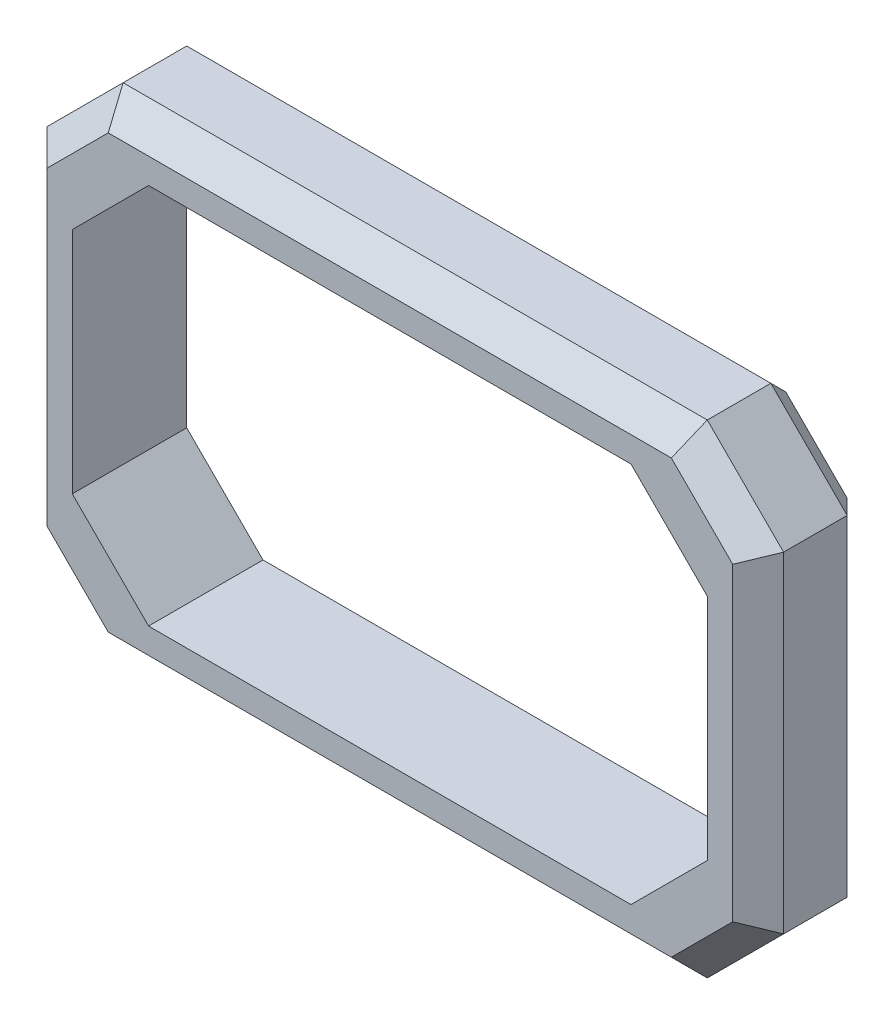
ISO-10303-21;
HEADER;
FILE_DESCRIPTION(('STEP AP214'),'2;1');
FILE_NAME('part.step','',(''),(''),'','','');
FILE_SCHEMA(('AUTOMOTIVE_DESIGN { 1 0 10303 214 1 1 1 1 }'));
ENDSEC;
DATA;
#1=APPLICATION_CONTEXT('core data for automotive mechanical design processes');
#2=APPLICATION_PROTOCOL_DEFINITION('international standard','automotive_design',2000,#1);
#3=PRODUCT_CONTEXT('',#1,'mechanical');
#4=PRODUCT('Part','Part','',(#3));
#5=PRODUCT_RELATED_PRODUCT_CATEGORY('part','',(#4));
#6=PRODUCT_DEFINITION_FORMATION('','',#4);
#7=PRODUCT_DEFINITION_CONTEXT('part definition',#1,'design');
#8=PRODUCT_DEFINITION('design','',#6,#7);
#9=PRODUCT_DEFINITION_SHAPE('','',#8);
#10=(LENGTH_UNIT() NAMED_UNIT(*) SI_UNIT(.MILLI.,.METRE.));
#11=(NAMED_UNIT(*) PLANE_ANGLE_UNIT() SI_UNIT($,.RADIAN.));
#12=(NAMED_UNIT(*) SI_UNIT($,.STERADIAN.) SOLID_ANGLE_UNIT());
#13=UNCERTAINTY_MEASURE_WITH_UNIT(LENGTH_MEASURE(1.E-05),#10,'distance_accuracy_value','');
#14=(GEOMETRIC_REPRESENTATION_CONTEXT(3) GLOBAL_UNCERTAINTY_ASSIGNED_CONTEXT((#13)) GLOBAL_UNIT_ASSIGNED_CONTEXT((#10,
#11,#12)) REPRESENTATION_CONTEXT('',''));
#15=CARTESIAN_POINT('',(0.,0.,0.));
#16=DIRECTION('',(0.,0.,1.));
#17=DIRECTION('',(1.,0.,0.));
#18=AXIS2_PLACEMENT_3D('',#15,#16,#17);
#19=CARTESIAN_POINT('',(0.,0.,45.));
#20=DIRECTION('',(0.,0.,1.));
#21=DIRECTION('',(1.,0.,0.));
#22=AXIS2_PLACEMENT_3D('',#19,#20,#21);
#23=PLANE('',#22);
#24=DIRECTION('',(0.,1.,0.));
#25=VECTOR('',#24,1.);
#26=CARTESIAN_POINT('',(134.838109564186,64.9999999999998,45.));
#27=LINE('',#26,#25);
#28=CARTESIAN_POINT('',(134.838109564186,-60.8578643762692,45.));
#29=VERTEX_POINT('',#28);
#30=CARTESIAN_POINT('',(134.838109564186,60.8578643762689,45.));
#31=VERTEX_POINT('',#30);
#32=EDGE_CURVE('E42',#29,#31,#27,.T.);
#33=ORIENTED_EDGE('',*,*,#32,.T.);
#34=DIRECTION('',(-0.707106781186545,0.70710678118655,0.));
#35=VECTOR('',#34,1.);
#36=CARTESIAN_POINT('',(97.8479869702279,97.8479869702273,45.));
#37=LINE('',#36,#35);
#38=CARTESIAN_POINT('',(110.695973940455,85.,45.));
#39=VERTEX_POINT('',#38);
#40=EDGE_CURVE('E11',#31,#39,#37,.T.);
#41=ORIENTED_EDGE('',*,*,#40,.T.);
#42=DIRECTION('',(-1.,0.,0.));
#43=VECTOR('',#42,1.);
#44=CARTESIAN_POINT('',(-114.838109564186,85.,45.));
#45=LINE('',#44,#43);
#46=CARTESIAN_POINT('',(-110.695973940455,85.,45.));
#47=VERTEX_POINT('',#46);
#48=EDGE_CURVE('E331',#39,#47,#45,.T.);
#49=ORIENTED_EDGE('',*,*,#48,.T.);
#50=DIRECTION('',(-0.70710678118655,-0.707106781186545,0.));
#51=VECTOR('',#50,1.);
#52=CARTESIAN_POINT('',(-97.8479869702271,97.8479869702278,45.));
#53=LINE('',#52,#51);
#54=CARTESIAN_POINT('',(-134.838109564186,60.8578643762691,45.));
#55=VERTEX_POINT('',#54);
#56=EDGE_CURVE('E329',#47,#55,#53,.T.);
#57=ORIENTED_EDGE('',*,*,#56,.T.);
#58=DIRECTION('',(0.,-1.,0.));
#59=VECTOR('',#58,1.);
#60=CARTESIAN_POINT('',(-134.838109564186,-64.9999999999999,45.));
#61=LINE('',#60,#59);
#62=CARTESIAN_POINT('',(-134.838109564186,-60.8578643762689,45.));
#63=VERTEX_POINT('',#62);
#64=EDGE_CURVE('E333',#55,#63,#61,.T.);
#65=ORIENTED_EDGE('',*,*,#64,.T.);
#66=DIRECTION('',(0.707106781186547,-0.707106781186548,0.));
#67=VECTOR('',#66,1.);
#68=CARTESIAN_POINT('',(-97.8479869702276,-97.8479869702274,45.));
#69=LINE('',#68,#67);
#70=CARTESIAN_POINT('',(-110.695973940455,-85.,45.));
#71=VERTEX_POINT('',#70);
#72=EDGE_CURVE('E335',#63,#71,#69,.T.);
#73=ORIENTED_EDGE('',*,*,#72,.T.);
#74=DIRECTION('',(1.,0.,0.));
#75=VECTOR('',#74,1.);
#76=CARTESIAN_POINT('',(114.838109564186,-85.,45.));
#77=LINE('',#76,#75);
#78=CARTESIAN_POINT('',(110.695973940455,-85.,45.));
#79=VERTEX_POINT('',#78);
#80=EDGE_CURVE('E337',#71,#79,#77,.T.);
#81=ORIENTED_EDGE('',*,*,#80,.T.);
#82=DIRECTION('',(0.70710678118655,0.707106781186545,0.));
#83=VECTOR('',#82,1.);
#84=CARTESIAN_POINT('',(97.8479869702272,-97.8479869702278,45.));
#85=LINE('',#84,#83);
#86=EDGE_CURVE('E53',#79,#29,#85,.T.);
#87=ORIENTED_EDGE('',*,*,#86,.T.);
#88=EDGE_LOOP('',(#33,#41,#49,#57,#65,#73,#81,#87));
#89=FACE_BOUND('',#88,.T.);
#90=DIRECTION('',(-1.,0.,0.));
#91=VECTOR('',#90,1.);
#92=CARTESIAN_POINT('',(-124.838109564186,75.,45.));
#93=LINE('',#92,#91);
#94=CARTESIAN_POINT('',(94.8381095641861,75.,45.));
#95=VERTEX_POINT('',#94);
#96=CARTESIAN_POINT('',(-94.8381095641858,75.,45.));
#97=VERTEX_POINT('',#96);
#98=EDGE_CURVE('E779',#95,#97,#93,.T.);
#99=ORIENTED_EDGE('',*,*,#98,.F.);
#100=DIRECTION('',(-0.707106781186544,0.707106781186551,0.));
#101=VECTOR('',#100,1.);
#102=CARTESIAN_POINT('',(124.838109564186,44.9999999999998,45.));
#103=LINE('',#102,#101);
#104=CARTESIAN_POINT('',(124.838109564186,44.9999999999998,45.));
#105=VERTEX_POINT('',#104);
#106=EDGE_CURVE('E206',#95,#105,#103,.F.);
#107=ORIENTED_EDGE('',*,*,#106,.T.);
#108=DIRECTION('',(0.,1.,0.));
#109=VECTOR('',#108,1.);
#110=CARTESIAN_POINT('',(124.838109564186,-75.,45.));
#111=LINE('',#110,#109);
#112=CARTESIAN_POINT('',(124.838109564186,-45.0000000000001,45.));
#113=VERTEX_POINT('',#112);
#114=EDGE_CURVE('E776',#113,#105,#111,.T.);
#115=ORIENTED_EDGE('',*,*,#114,.F.);
#116=DIRECTION('',(0.707106781186551,0.707106781186544,0.));
#117=VECTOR('',#116,1.);
#118=CARTESIAN_POINT('',(94.8381095641857,-75.,45.));
#119=LINE('',#118,#117);
#120=CARTESIAN_POINT('',(94.8381095641857,-75.,45.));
#121=VERTEX_POINT('',#120);
#122=EDGE_CURVE('E272',#113,#121,#119,.F.);
#123=ORIENTED_EDGE('',*,*,#122,.T.);
#124=DIRECTION('',(1.,0.,0.));
#125=VECTOR('',#124,1.);
#126=CARTESIAN_POINT('',(-124.838109564186,-75.,45.));
#127=LINE('',#126,#125);
#128=CARTESIAN_POINT('',(-94.8381095641861,-75.,45.));
#129=VERTEX_POINT('',#128);
#130=EDGE_CURVE('E220',#129,#121,#127,.T.);
#131=ORIENTED_EDGE('',*,*,#130,.F.);
#132=DIRECTION('',(0.707106781186544,-0.707106781186551,0.));
#133=VECTOR('',#132,1.);
#134=CARTESIAN_POINT('',(-124.838109564186,-44.9999999999998,45.));
#135=LINE('',#134,#133);
#136=CARTESIAN_POINT('',(-124.838109564186,-44.9999999999998,45.));
#137=VERTEX_POINT('',#136);
#138=EDGE_CURVE('E268',#129,#137,#135,.F.);
#139=ORIENTED_EDGE('',*,*,#138,.T.);
#140=DIRECTION('',(0.,-1.,0.));
#141=VECTOR('',#140,1.);
#142=CARTESIAN_POINT('',(-124.838109564186,-75.,45.));
#143=LINE('',#142,#141);
#144=CARTESIAN_POINT('',(-124.838109564186,45.0000000000001,45.));
#145=VERTEX_POINT('',#144);
#146=EDGE_CURVE('E225',#145,#137,#143,.T.);
#147=ORIENTED_EDGE('',*,*,#146,.F.);
#148=DIRECTION('',(-0.707106781186551,-0.707106781186544,0.));
#149=VECTOR('',#148,1.);
#150=CARTESIAN_POINT('',(-94.8381095641858,75.,45.));
#151=LINE('',#150,#149);
#152=EDGE_CURVE('E205',#145,#97,#151,.F.);
#153=ORIENTED_EDGE('',*,*,#152,.T.);
#154=EDGE_LOOP('',(#99,#107,#115,#123,#131,#139,#147,#153));
#155=FACE_BOUND('',#154,.T.);
#156=ADVANCED_FACE('F33',(#89,#155),#23,.T.);
#157=CARTESIAN_POINT('',(0.,0.,0.));
#158=DIRECTION('',(0.,0.,1.));
#159=DIRECTION('',(1.,0.,0.));
#160=AXIS2_PLACEMENT_3D('',#157,#158,#159);
#161=PLANE('',#160);
#162=DIRECTION('',(-1.,0.,0.));
#163=VECTOR('',#162,1.);
#164=CARTESIAN_POINT('',(0.,-84.9999999999999,0.));
#165=LINE('',#164,#163);
#166=CARTESIAN_POINT('',(110.695973940455,-84.9999999999999,0.));
#167=VERTEX_POINT('',#166);
#168=CARTESIAN_POINT('',(-110.695973940455,-84.9999999999999,0.));
#169=VERTEX_POINT('',#168);
#170=EDGE_CURVE('E290',#167,#169,#165,.T.);
#171=ORIENTED_EDGE('',*,*,#170,.T.);
#172=DIRECTION('',(-0.707106781186547,0.707106781186548,0.));
#173=VECTOR('',#172,1.);
#174=CARTESIAN_POINT('',(-137.76704175232,-57.9289321881343,0.));
#175=LINE('',#174,#173);
#176=CARTESIAN_POINT('',(-134.838109564186,-60.8578643762689,0.));
#177=VERTEX_POINT('',#176);
#178=EDGE_CURVE('E292',#169,#177,#175,.T.);
#179=ORIENTED_EDGE('',*,*,#178,.T.);
#180=DIRECTION('',(0.,1.,0.));
#181=VECTOR('',#180,1.);
#182=CARTESIAN_POINT('',(-134.838109564186,0.,0.));
#183=LINE('',#182,#181);
#184=CARTESIAN_POINT('',(-134.838109564186,60.8578643762691,0.));
#185=VERTEX_POINT('',#184);
#186=EDGE_CURVE('E278',#177,#185,#183,.T.);
#187=ORIENTED_EDGE('',*,*,#186,.T.);
#188=DIRECTION('',(0.70710678118655,0.707106781186545,0.));
#189=VECTOR('',#188,1.);
#190=CARTESIAN_POINT('',(-107.76704175232,87.9289321881344,0.));
#191=LINE('',#190,#189);
#192=CARTESIAN_POINT('',(-110.695973940455,84.9999999999999,0.));
#193=VERTEX_POINT('',#192);
#194=EDGE_CURVE('E280',#185,#193,#191,.T.);
#195=ORIENTED_EDGE('',*,*,#194,.T.);
#196=DIRECTION('',(1.,0.,0.));
#197=VECTOR('',#196,1.);
#198=CARTESIAN_POINT('',(0.,84.9999999999999,0.));
#199=LINE('',#198,#197);
#200=CARTESIAN_POINT('',(110.695973940455,84.9999999999999,0.));
#201=VERTEX_POINT('',#200);
#202=EDGE_CURVE('E282',#193,#201,#199,.T.);
#203=ORIENTED_EDGE('',*,*,#202,.T.);
#204=DIRECTION('',(0.707106781186545,-0.70710678118655,0.));
#205=VECTOR('',#204,1.);
#206=CARTESIAN_POINT('',(137.767041752321,57.9289321881343,0.));
#207=LINE('',#206,#205);
#208=CARTESIAN_POINT('',(134.838109564186,60.8578643762689,0.));
#209=VERTEX_POINT('',#208);
#210=EDGE_CURVE('E284',#201,#209,#207,.T.);
#211=ORIENTED_EDGE('',*,*,#210,.T.);
#212=DIRECTION('',(0.,-1.,0.));
#213=VECTOR('',#212,1.);
#214=CARTESIAN_POINT('',(134.838109564186,0.,0.));
#215=LINE('',#214,#213);
#216=CARTESIAN_POINT('',(134.838109564186,-60.8578643762691,0.));
#217=VERTEX_POINT('',#216);
#218=EDGE_CURVE('E286',#209,#217,#215,.T.);
#219=ORIENTED_EDGE('',*,*,#218,.T.);
#220=DIRECTION('',(-0.70710678118655,-0.707106781186545,0.));
#221=VECTOR('',#220,1.);
#222=CARTESIAN_POINT('',(107.76704175232,-87.9289321881344,0.));
#223=LINE('',#222,#221);
#224=EDGE_CURVE('E288',#217,#167,#223,.T.);
#225=ORIENTED_EDGE('',*,*,#224,.T.);
#226=EDGE_LOOP('',(#171,#179,#187,#195,#203,#211,#219,#225));
#227=FACE_BOUND('',#226,.T.);
#228=DIRECTION('',(1.,0.,0.));
#229=VECTOR('',#228,1.);
#230=CARTESIAN_POINT('',(-124.838109564186,-75.,0.));
#231=LINE('',#230,#229);
#232=CARTESIAN_POINT('',(-94.8381095641861,-75.,0.));
#233=VERTEX_POINT('',#232);
#234=CARTESIAN_POINT('',(94.8381095641857,-75.,0.));
#235=VERTEX_POINT('',#234);
#236=EDGE_CURVE('E216',#233,#235,#231,.T.);
#237=ORIENTED_EDGE('',*,*,#236,.T.);
#238=DIRECTION('',(-0.707106781186551,-0.707106781186544,0.));
#239=VECTOR('',#238,1.);
#240=CARTESIAN_POINT('',(84.9190547820923,-84.9190547820933,0.));
#241=LINE('',#240,#239);
#242=CARTESIAN_POINT('',(124.838109564186,-45.0000000000001,0.));
#243=VERTEX_POINT('',#242);
#244=EDGE_CURVE('E270',#235,#243,#241,.F.);
#245=ORIENTED_EDGE('',*,*,#244,.T.);
#246=DIRECTION('',(0.,1.,0.));
#247=VECTOR('',#246,1.);
#248=CARTESIAN_POINT('',(124.838109564186,-75.,0.));
#249=LINE('',#248,#247);
#250=CARTESIAN_POINT('',(124.838109564186,44.9999999999998,0.));
#251=VERTEX_POINT('',#250);
#252=EDGE_CURVE('E363',#243,#251,#249,.T.);
#253=ORIENTED_EDGE('',*,*,#252,.T.);
#254=DIRECTION('',(0.707106781186544,-0.707106781186551,0.));
#255=VECTOR('',#254,1.);
#256=CARTESIAN_POINT('',(84.9190547820936,84.9190547820927,0.));
#257=LINE('',#256,#255);
#258=CARTESIAN_POINT('',(94.8381095641861,75.,0.));
#259=VERTEX_POINT('',#258);
#260=EDGE_CURVE('E274',#251,#259,#257,.F.);
#261=ORIENTED_EDGE('',*,*,#260,.T.);
#262=DIRECTION('',(-1.,0.,0.));
#263=VECTOR('',#262,1.);
#264=CARTESIAN_POINT('',(-124.838109564186,75.,0.));
#265=LINE('',#264,#263);
#266=CARTESIAN_POINT('',(-94.8381095641858,75.,0.));
#267=VERTEX_POINT('',#266);
#268=EDGE_CURVE('E200',#259,#267,#265,.T.);
#269=ORIENTED_EDGE('',*,*,#268,.T.);
#270=DIRECTION('',(0.707106781186551,0.707106781186544,0.));
#271=VECTOR('',#270,1.);
#272=CARTESIAN_POINT('',(-84.9190547820924,84.9190547820933,0.));
#273=LINE('',#272,#271);
#274=CARTESIAN_POINT('',(-124.838109564186,45.0000000000001,0.));
#275=VERTEX_POINT('',#274);
#276=EDGE_CURVE('E194',#267,#275,#273,.F.);
#277=ORIENTED_EDGE('',*,*,#276,.T.);
#278=DIRECTION('',(0.,-1.,0.));
#279=VECTOR('',#278,1.);
#280=CARTESIAN_POINT('',(-124.838109564186,-75.,0.));
#281=LINE('',#280,#279);
#282=CARTESIAN_POINT('',(-124.838109564186,-44.9999999999998,0.));
#283=VERTEX_POINT('',#282);
#284=EDGE_CURVE('E198',#275,#283,#281,.T.);
#285=ORIENTED_EDGE('',*,*,#284,.T.);
#286=DIRECTION('',(-0.707106781186544,0.707106781186551,0.));
#287=VECTOR('',#286,1.);
#288=CARTESIAN_POINT('',(-84.9190547820935,-84.9190547820927,0.));
#289=LINE('',#288,#287);
#290=EDGE_CURVE('E266',#283,#233,#289,.F.);
#291=ORIENTED_EDGE('',*,*,#290,.T.);
#292=EDGE_LOOP('',(#237,#245,#253,#261,#269,#277,#285,#291));
#293=FACE_BOUND('',#292,.T.);
#294=ADVANCED_FACE('F197',(#227,#293),#161,.F.);
#295=CARTESIAN_POINT('',(-144.838109564186,-95.,45.));
#296=DIRECTION('',(1.,0.,0.));
#297=DIRECTION('',(0.,0.,-1.));
#298=AXIS2_PLACEMENT_3D('',#295,#296,#297);
#299=PLANE('',#298);
#300=DIRECTION('',(0.,0.,-1.));
#301=VECTOR('',#300,1.);
#302=CARTESIAN_POINT('',(-144.838109564186,65.0000000000001,45.));
#303=LINE('',#302,#301);
#304=CARTESIAN_POINT('',(-144.838109564186,65.0000000000001,35.));
#305=VERTEX_POINT('',#304);
#306=CARTESIAN_POINT('',(-144.838109564186,65.0000000000001,10.));
#307=VERTEX_POINT('',#306);
#308=EDGE_CURVE('E260',#305,#307,#303,.T.);
#309=ORIENTED_EDGE('',*,*,#308,.T.);
#310=DIRECTION('',(0.,-1.,0.));
#311=VECTOR('',#310,1.);
#312=CARTESIAN_POINT('',(-144.838109564186,-95.,10.));
#313=LINE('',#312,#311);
#314=CARTESIAN_POINT('',(-144.838109564186,-64.9999999999999,10.));
#315=VERTEX_POINT('',#314);
#316=EDGE_CURVE('E327',#307,#315,#313,.T.);
#317=ORIENTED_EDGE('',*,*,#316,.T.);
#318=DIRECTION('',(0.,0.,1.));
#319=VECTOR('',#318,1.);
#320=CARTESIAN_POINT('',(-144.838109564186,-64.9999999999999,45.));
#321=LINE('',#320,#319);
#322=CARTESIAN_POINT('',(-144.838109564186,-64.9999999999999,35.));
#323=VERTEX_POINT('',#322);
#324=EDGE_CURVE('E263',#315,#323,#321,.T.);
#325=ORIENTED_EDGE('',*,*,#324,.T.);
#326=DIRECTION('',(0.,1.,0.));
#327=VECTOR('',#326,1.);
#328=CARTESIAN_POINT('',(-144.838109564186,65.0000000000001,35.));
#329=LINE('',#328,#327);
#330=EDGE_CURVE('E325',#323,#305,#329,.T.);
#331=ORIENTED_EDGE('',*,*,#330,.T.);
#332=EDGE_LOOP('',(#309,#317,#325,#331));
#333=FACE_BOUND('',#332,.T.);
#334=ADVANCED_FACE('F401',(#333),#299,.F.);
#335=CARTESIAN_POINT('',(144.838109564186,-95.,45.));
#336=DIRECTION('',(0.,1.,0.));
#337=DIRECTION('',(-1.,0.,0.));
#338=AXIS2_PLACEMENT_3D('',#335,#336,#337);
#339=PLANE('',#338);
#340=DIRECTION('',(0.,0.,-1.));
#341=VECTOR('',#340,1.);
#342=CARTESIAN_POINT('',(-114.838109564186,-95.,45.));
#343=LINE('',#342,#341);
#344=CARTESIAN_POINT('',(-114.838109564186,-95.,35.));
#345=VERTEX_POINT('',#344);
#346=CARTESIAN_POINT('',(-114.838109564186,-95.,10.));
#347=VERTEX_POINT('',#346);
#348=EDGE_CURVE('E248',#345,#347,#343,.T.);
#349=ORIENTED_EDGE('',*,*,#348,.T.);
#350=DIRECTION('',(1.,0.,0.));
#351=VECTOR('',#350,1.);
#352=CARTESIAN_POINT('',(144.838109564186,-95.,10.));
#353=LINE('',#352,#351);
#354=CARTESIAN_POINT('',(114.838109564186,-95.,10.));
#355=VERTEX_POINT('',#354);
#356=EDGE_CURVE('E302',#347,#355,#353,.T.);
#357=ORIENTED_EDGE('',*,*,#356,.T.);
#358=DIRECTION('',(0.,0.,1.));
#359=VECTOR('',#358,1.);
#360=CARTESIAN_POINT('',(114.838109564186,-95.,45.));
#361=LINE('',#360,#359);
#362=CARTESIAN_POINT('',(114.838109564186,-95.,35.));
#363=VERTEX_POINT('',#362);
#364=EDGE_CURVE('E251',#355,#363,#361,.T.);
#365=ORIENTED_EDGE('',*,*,#364,.T.);
#366=DIRECTION('',(-1.,0.,0.));
#367=VECTOR('',#366,1.);
#368=CARTESIAN_POINT('',(-114.838109564186,-95.,35.));
#369=LINE('',#368,#367);
#370=EDGE_CURVE('E300',#363,#345,#369,.T.);
#371=ORIENTED_EDGE('',*,*,#370,.T.);
#372=EDGE_LOOP('',(#349,#357,#365,#371));
#373=FACE_BOUND('',#372,.T.);
#374=ADVANCED_FACE('F415',(#373),#339,.F.);
#375=CARTESIAN_POINT('',(144.838109564186,-95.,45.));
#376=DIRECTION('',(-1.,0.,0.));
#377=DIRECTION('',(0.,0.,1.));
#378=AXIS2_PLACEMENT_3D('',#375,#376,#377);
#379=PLANE('',#378);
#380=DIRECTION('',(0.,0.,-1.));
#381=VECTOR('',#380,1.);
#382=CARTESIAN_POINT('',(144.838109564186,-65.0000000000001,45.));
#383=LINE('',#382,#381);
#384=CARTESIAN_POINT('',(144.838109564186,-65.0000000000001,35.));
#385=VERTEX_POINT('',#384);
#386=CARTESIAN_POINT('',(144.838109564186,-65.0000000000001,10.));
#387=VERTEX_POINT('',#386);
#388=EDGE_CURVE('E245',#385,#387,#383,.T.);
#389=ORIENTED_EDGE('',*,*,#388,.T.);
#390=DIRECTION('',(0.,1.,0.));
#391=VECTOR('',#390,1.);
#392=CARTESIAN_POINT('',(144.838109564186,-95.,10.));
#393=LINE('',#392,#391);
#394=CARTESIAN_POINT('',(144.838109564186,64.9999999999998,10.));
#395=VERTEX_POINT('',#394);
#396=EDGE_CURVE('E310',#387,#395,#393,.T.);
#397=ORIENTED_EDGE('',*,*,#396,.T.);
#398=DIRECTION('',(0.,0.,1.));
#399=VECTOR('',#398,1.);
#400=CARTESIAN_POINT('',(144.838109564186,64.9999999999998,45.));
#401=LINE('',#400,#399);
#402=CARTESIAN_POINT('',(144.838109564186,64.9999999999998,35.));
#403=VERTEX_POINT('',#402);
#404=EDGE_CURVE('E242',#395,#403,#401,.T.);
#405=ORIENTED_EDGE('',*,*,#404,.T.);
#406=DIRECTION('',(0.,-1.,0.));
#407=VECTOR('',#406,1.);
#408=CARTESIAN_POINT('',(144.838109564186,-65.0000000000001,35.));
#409=LINE('',#408,#407);
#410=EDGE_CURVE('E308',#403,#385,#409,.T.);
#411=ORIENTED_EDGE('',*,*,#410,.T.);
#412=EDGE_LOOP('',(#389,#397,#405,#411));
#413=FACE_BOUND('',#412,.T.);
#414=ADVANCED_FACE('F439',(#413),#379,.F.);
#415=CARTESIAN_POINT('',(144.838109564186,95.,45.));
#416=DIRECTION('',(0.,-1.,0.));
#417=DIRECTION('',(0.,0.,-1.));
#418=AXIS2_PLACEMENT_3D('',#415,#416,#417);
#419=PLANE('',#418);
#420=DIRECTION('',(0.,0.,-1.));
#421=VECTOR('',#420,1.);
#422=CARTESIAN_POINT('',(114.838109564186,95.,45.));
#423=LINE('',#422,#421);
#424=CARTESIAN_POINT('',(114.838109564186,95.,35.));
#425=VERTEX_POINT('',#424);
#426=CARTESIAN_POINT('',(114.838109564186,95.,10.));
#427=VERTEX_POINT('',#426);
#428=EDGE_CURVE('E257',#425,#427,#423,.T.);
#429=ORIENTED_EDGE('',*,*,#428,.T.);
#430=DIRECTION('',(-1.,0.,0.));
#431=VECTOR('',#430,1.);
#432=CARTESIAN_POINT('',(144.838109564186,95.,10.));
#433=LINE('',#432,#431);
#434=CARTESIAN_POINT('',(-114.838109564186,95.,10.));
#435=VERTEX_POINT('',#434);
#436=EDGE_CURVE('E319',#427,#435,#433,.T.);
#437=ORIENTED_EDGE('',*,*,#436,.T.);
#438=DIRECTION('',(0.,0.,1.));
#439=VECTOR('',#438,1.);
#440=CARTESIAN_POINT('',(-114.838109564186,95.,45.));
#441=LINE('',#440,#439);
#442=CARTESIAN_POINT('',(-114.838109564186,95.,35.));
#443=VERTEX_POINT('',#442);
#444=EDGE_CURVE('E254',#435,#443,#441,.T.);
#445=ORIENTED_EDGE('',*,*,#444,.T.);
#446=DIRECTION('',(1.,0.,0.));
#447=VECTOR('',#446,1.);
#448=CARTESIAN_POINT('',(114.838109564186,95.,35.));
#449=LINE('',#448,#447);
#450=EDGE_CURVE('E317',#443,#425,#449,.T.);
#451=ORIENTED_EDGE('',*,*,#450,.T.);
#452=EDGE_LOOP('',(#429,#437,#445,#451));
#453=FACE_BOUND('',#452,.T.);
#454=ADVANCED_FACE('F456',(#453),#419,.F.);
#455=CARTESIAN_POINT('',(124.838109564186,-75.,45.));
#456=DIRECTION('',(-1.,0.,0.));
#457=DIRECTION('',(0.,-1.,0.));
#458=AXIS2_PLACEMENT_3D('',#455,#456,#457);
#459=PLANE('',#458);
#460=ORIENTED_EDGE('',*,*,#252,.F.);
#461=DIRECTION('',(0.,0.,1.));
#462=VECTOR('',#461,1.);
#463=CARTESIAN_POINT('',(124.838109564186,-45.0000000000001,45.));
#464=LINE('',#463,#462);
#465=EDGE_CURVE('E236',#243,#113,#464,.T.);
#466=ORIENTED_EDGE('',*,*,#465,.T.);
#467=ORIENTED_EDGE('',*,*,#114,.T.);
#468=DIRECTION('',(0.,0.,-1.));
#469=VECTOR('',#468,1.);
#470=CARTESIAN_POINT('',(124.838109564186,44.9999999999998,0.));
#471=LINE('',#470,#469);
#472=EDGE_CURVE('E233',#105,#251,#471,.T.);
#473=ORIENTED_EDGE('',*,*,#472,.T.);
#474=EDGE_LOOP('',(#460,#466,#467,#473));
#475=FACE_BOUND('',#474,.T.);
#476=ADVANCED_FACE('F495',(#475),#459,.T.);
#477=CARTESIAN_POINT('',(-124.838109564186,75.,45.));
#478=DIRECTION('',(0.,-1.,0.));
#479=DIRECTION('',(0.,0.,-1.));
#480=AXIS2_PLACEMENT_3D('',#477,#478,#479);
#481=PLANE('',#480);
#482=ORIENTED_EDGE('',*,*,#268,.F.);
#483=DIRECTION('',(0.,0.,1.));
#484=VECTOR('',#483,1.);
#485=CARTESIAN_POINT('',(94.8381095641861,75.,45.));
#486=LINE('',#485,#484);
#487=EDGE_CURVE('E240',#259,#95,#486,.T.);
#488=ORIENTED_EDGE('',*,*,#487,.T.);
#489=ORIENTED_EDGE('',*,*,#98,.T.);
#490=DIRECTION('',(0.,0.,-1.));
#491=VECTOR('',#490,1.);
#492=CARTESIAN_POINT('',(-94.8381095641858,75.,0.));
#493=LINE('',#492,#491);
#494=EDGE_CURVE('E238',#97,#267,#493,.T.);
#495=ORIENTED_EDGE('',*,*,#494,.T.);
#496=EDGE_LOOP('',(#482,#488,#489,#495));
#497=FACE_BOUND('',#496,.T.);
#498=ADVANCED_FACE('F692',(#497),#481,.T.);
#499=CARTESIAN_POINT('',(-124.838109564186,-75.,45.));
#500=DIRECTION('',(1.,0.,0.));
#501=DIRECTION('',(0.,1.,0.));
#502=AXIS2_PLACEMENT_3D('',#499,#500,#501);
#503=PLANE('',#502);
#504=ORIENTED_EDGE('',*,*,#146,.T.);
#505=DIRECTION('',(0.,0.,-1.));
#506=VECTOR('',#505,1.);
#507=CARTESIAN_POINT('',(-124.838109564186,-44.9999999999998,0.));
#508=LINE('',#507,#506);
#509=EDGE_CURVE('E215',#137,#283,#508,.T.);
#510=ORIENTED_EDGE('',*,*,#509,.T.);
#511=ORIENTED_EDGE('',*,*,#284,.F.);
#512=DIRECTION('',(0.,0.,1.));
#513=VECTOR('',#512,1.);
#514=CARTESIAN_POINT('',(-124.838109564186,45.0000000000001,45.));
#515=LINE('',#514,#513);
#516=EDGE_CURVE('E212',#275,#145,#515,.T.);
#517=ORIENTED_EDGE('',*,*,#516,.T.);
#518=EDGE_LOOP('',(#504,#510,#511,#517));
#519=FACE_BOUND('',#518,.T.);
#520=ADVANCED_FACE('F211',(#519),#503,.T.);
#521=CARTESIAN_POINT('',(-124.838109564186,-75.,45.));
#522=DIRECTION('',(0.,1.,0.));
#523=DIRECTION('',(0.,0.,1.));
#524=AXIS2_PLACEMENT_3D('',#521,#522,#523);
#525=PLANE('',#524);
#526=ORIENTED_EDGE('',*,*,#236,.F.);
#527=DIRECTION('',(0.,0.,1.));
#528=VECTOR('',#527,1.);
#529=CARTESIAN_POINT('',(-94.8381095641861,-75.,45.));
#530=LINE('',#529,#528);
#531=EDGE_CURVE('E231',#233,#129,#530,.T.);
#532=ORIENTED_EDGE('',*,*,#531,.T.);
#533=ORIENTED_EDGE('',*,*,#130,.T.);
#534=DIRECTION('',(0.,0.,-1.));
#535=VECTOR('',#534,1.);
#536=CARTESIAN_POINT('',(94.8381095641857,-75.,0.));
#537=LINE('',#536,#535);
#538=EDGE_CURVE('E222',#121,#235,#537,.T.);
#539=ORIENTED_EDGE('',*,*,#538,.T.);
#540=EDGE_LOOP('',(#526,#532,#533,#539));
#541=FACE_BOUND('',#540,.T.);
#542=ADVANCED_FACE('F510',(#541),#525,.T.);
#543=CARTESIAN_POINT('',(-124.838109564186,-44.9999999999998,45.));
#544=DIRECTION('',(0.707106781186551,0.707106781186544,0.));
#545=DIRECTION('',(0.,0.,1.));
#546=AXIS2_PLACEMENT_3D('',#543,#544,#545);
#547=PLANE('',#546);
#548=ORIENTED_EDGE('',*,*,#138,.F.);
#549=ORIENTED_EDGE('',*,*,#531,.F.);
#550=ORIENTED_EDGE('',*,*,#290,.F.);
#551=ORIENTED_EDGE('',*,*,#509,.F.);
#552=EDGE_LOOP('',(#548,#549,#550,#551));
#553=FACE_BOUND('',#552,.T.);
#554=ADVANCED_FACE('F506',(#553),#547,.T.);
#555=CARTESIAN_POINT('',(94.8381095641857,-75.,45.));
#556=DIRECTION('',(-0.707106781186544,0.707106781186551,0.));
#557=DIRECTION('',(0.,0.,1.));
#558=AXIS2_PLACEMENT_3D('',#555,#556,#557);
#559=PLANE('',#558);
#560=ORIENTED_EDGE('',*,*,#122,.F.);
#561=ORIENTED_EDGE('',*,*,#465,.F.);
#562=ORIENTED_EDGE('',*,*,#244,.F.);
#563=ORIENTED_EDGE('',*,*,#538,.F.);
#564=EDGE_LOOP('',(#560,#561,#562,#563));
#565=FACE_BOUND('',#564,.T.);
#566=ADVANCED_FACE('F509',(#565),#559,.T.);
#567=CARTESIAN_POINT('',(124.838109564186,44.9999999999998,45.));
#568=DIRECTION('',(-0.707106781186551,-0.707106781186544,0.));
#569=DIRECTION('',(0.,0.,1.));
#570=AXIS2_PLACEMENT_3D('',#567,#568,#569);
#571=PLANE('',#570);
#572=ORIENTED_EDGE('',*,*,#106,.F.);
#573=ORIENTED_EDGE('',*,*,#487,.F.);
#574=ORIENTED_EDGE('',*,*,#260,.F.);
#575=ORIENTED_EDGE('',*,*,#472,.F.);
#576=EDGE_LOOP('',(#572,#573,#574,#575));
#577=FACE_BOUND('',#576,.T.);
#578=ADVANCED_FACE('F514',(#577),#571,.T.);
#579=CARTESIAN_POINT('',(-94.8381095641858,75.,45.));
#580=DIRECTION('',(0.707106781186544,-0.707106781186551,0.));
#581=DIRECTION('',(0.,0.,1.));
#582=AXIS2_PLACEMENT_3D('',#579,#580,#581);
#583=PLANE('',#582);
#584=ORIENTED_EDGE('',*,*,#152,.F.);
#585=ORIENTED_EDGE('',*,*,#516,.F.);
#586=ORIENTED_EDGE('',*,*,#276,.F.);
#587=ORIENTED_EDGE('',*,*,#494,.F.);
#588=EDGE_LOOP('',(#584,#585,#586,#587));
#589=FACE_BOUND('',#588,.T.);
#590=ADVANCED_FACE('F219',(#589),#583,.T.);
#591=CARTESIAN_POINT('',(144.838109564186,-65.0000000000001,45.));
#592=DIRECTION('',(-0.707106781186545,0.70710678118655,0.));
#593=DIRECTION('',(0.,0.,-1.));
#594=AXIS2_PLACEMENT_3D('',#591,#592,#593);
#595=PLANE('',#594);
#596=ORIENTED_EDGE('',*,*,#364,.F.);
#597=DIRECTION('',(-0.70710678118655,-0.707106781186545,0.));
#598=VECTOR('',#597,1.);
#599=CARTESIAN_POINT('',(144.838109564186,-65.0000000000001,10.));
#600=LINE('',#599,#598);
#601=EDGE_CURVE('E306',#355,#387,#600,.F.);
#602=ORIENTED_EDGE('',*,*,#601,.T.);
#603=ORIENTED_EDGE('',*,*,#388,.F.);
#604=DIRECTION('',(0.70710678118655,0.707106781186545,0.));
#605=VECTOR('',#604,1.);
#606=CARTESIAN_POINT('',(144.838109564186,-65.0000000000001,35.));
#607=LINE('',#606,#605);
#608=EDGE_CURVE('E304',#385,#363,#607,.F.);
#609=ORIENTED_EDGE('',*,*,#608,.T.);
#610=EDGE_LOOP('',(#596,#602,#603,#609));
#611=FACE_BOUND('',#610,.T.);
#612=ADVANCED_FACE('F419',(#611),#595,.F.);
#613=CARTESIAN_POINT('',(114.838109564186,95.,45.));
#614=DIRECTION('',(-0.70710678118655,-0.707106781186545,0.));
#615=DIRECTION('',(0.,0.,-1.));
#616=AXIS2_PLACEMENT_3D('',#613,#614,#615);
#617=PLANE('',#616);
#618=ORIENTED_EDGE('',*,*,#404,.F.);
#619=DIRECTION('',(0.707106781186545,-0.70710678118655,0.));
#620=VECTOR('',#619,1.);
#621=CARTESIAN_POINT('',(114.838109564186,95.,10.));
#622=LINE('',#621,#620);
#623=EDGE_CURVE('E315',#395,#427,#622,.F.);
#624=ORIENTED_EDGE('',*,*,#623,.T.);
#625=ORIENTED_EDGE('',*,*,#428,.F.);
#626=DIRECTION('',(-0.707106781186545,0.70710678118655,0.));
#627=VECTOR('',#626,1.);
#628=CARTESIAN_POINT('',(114.838109564186,95.,35.));
#629=LINE('',#628,#627);
#630=EDGE_CURVE('E312',#425,#403,#629,.F.);
#631=ORIENTED_EDGE('',*,*,#630,.T.);
#632=EDGE_LOOP('',(#618,#624,#625,#631));
#633=FACE_BOUND('',#632,.T.);
#634=ADVANCED_FACE('F442',(#633),#617,.F.);
#635=CARTESIAN_POINT('',(-114.838109564186,-95.,45.));
#636=DIRECTION('',(0.707106781186548,0.707106781186547,0.));
#637=DIRECTION('',(0.,0.,-1.));
#638=AXIS2_PLACEMENT_3D('',#635,#636,#637);
#639=PLANE('',#638);
#640=ORIENTED_EDGE('',*,*,#324,.F.);
#641=DIRECTION('',(-0.707106781186547,0.707106781186548,0.));
#642=VECTOR('',#641,1.);
#643=CARTESIAN_POINT('',(-114.838109564186,-95.,10.));
#644=LINE('',#643,#642);
#645=EDGE_CURVE('E297',#315,#347,#644,.F.);
#646=ORIENTED_EDGE('',*,*,#645,.T.);
#647=ORIENTED_EDGE('',*,*,#348,.F.);
#648=DIRECTION('',(0.707106781186547,-0.707106781186548,0.));
#649=VECTOR('',#648,1.);
#650=CARTESIAN_POINT('',(-114.838109564186,-95.,35.));
#651=LINE('',#650,#649);
#652=EDGE_CURVE('E295',#345,#323,#651,.F.);
#653=ORIENTED_EDGE('',*,*,#652,.T.);
#654=EDGE_LOOP('',(#640,#646,#647,#653));
#655=FACE_BOUND('',#654,.T.);
#656=ADVANCED_FACE('F398',(#655),#639,.F.);
#657=CARTESIAN_POINT('',(-144.838109564186,65.0000000000001,45.));
#658=DIRECTION('',(0.707106781186545,-0.70710678118655,0.));
#659=DIRECTION('',(0.,0.,-1.));
#660=AXIS2_PLACEMENT_3D('',#657,#658,#659);
#661=PLANE('',#660);
#662=ORIENTED_EDGE('',*,*,#444,.F.);
#663=DIRECTION('',(0.70710678118655,0.707106781186545,0.));
#664=VECTOR('',#663,1.);
#665=CARTESIAN_POINT('',(-144.838109564186,65.0000000000001,10.));
#666=LINE('',#665,#664);
#667=EDGE_CURVE('E323',#435,#307,#666,.F.);
#668=ORIENTED_EDGE('',*,*,#667,.T.);
#669=ORIENTED_EDGE('',*,*,#308,.F.);
#670=DIRECTION('',(-0.70710678118655,-0.707106781186545,0.));
#671=VECTOR('',#670,1.);
#672=CARTESIAN_POINT('',(-144.838109564186,65.0000000000001,35.));
#673=LINE('',#672,#671);
#674=EDGE_CURVE('E321',#305,#443,#673,.F.);
#675=ORIENTED_EDGE('',*,*,#674,.T.);
#676=EDGE_LOOP('',(#662,#668,#669,#675));
#677=FACE_BOUND('',#676,.T.);
#678=ADVANCED_FACE('F459',(#677),#661,.F.);
#679=CARTESIAN_POINT('',(97.8479869702279,97.8479869702272,0.));
#680=DIRECTION('',(-0.5,-0.499999999999997,0.707106781186549));
#681=DIRECTION('',(0.707106781186545,-0.70710678118655,0.));
#682=AXIS2_PLACEMENT_3D('',#679,#680,#681);
#683=PLANE('',#682);
#684=DIRECTION('',(-0.281084637714822,-0.678598344545849,-0.678598344545845));
#685=VECTOR('',#684,1.);
#686=CARTESIAN_POINT('',(117.208366770964,100.722307094916,15.7223070949164));
#687=LINE('',#686,#685);
#688=EDGE_CURVE('E357',#427,#201,#687,.T.);
#689=ORIENTED_EDGE('',*,*,#688,.F.);
#690=ORIENTED_EDGE('',*,*,#623,.F.);
#691=DIRECTION('',(-0.678598344545849,-0.28108463771482,-0.678598344545845));
#692=VECTOR('',#691,1.);
#693=CARTESIAN_POINT('',(124.859944710214,56.724773166159,-9.97816485397233));
#694=LINE('',#693,#692);
#695=EDGE_CURVE('E360',#209,#395,#694,.F.);
#696=ORIENTED_EDGE('',*,*,#695,.F.);
#697=ORIENTED_EDGE('',*,*,#210,.F.);
#698=EDGE_LOOP('',(#689,#690,#696,#697));
#699=FACE_BOUND('',#698,.T.);
#700=ADVANCED_FACE('F447',(#699),#683,.F.);
#701=CARTESIAN_POINT('',(144.838109564186,-95.,10.));
#702=DIRECTION('',(-0.707106781186545,0.,0.707106781186549));
#703=DIRECTION('',(0.,1.,0.));
#704=AXIS2_PLACEMENT_3D('',#701,#702,#703);
#705=PLANE('',#704);
#706=ORIENTED_EDGE('',*,*,#695,.T.);
#707=ORIENTED_EDGE('',*,*,#396,.F.);
#708=DIRECTION('',(-0.678598344545848,0.281084637714824,-0.678598344545844));
#709=VECTOR('',#708,1.);
#710=CARTESIAN_POINT('',(150.560416659102,-67.3702572067783,15.7223070949164));
#711=LINE('',#710,#709);
#712=EDGE_CURVE('E354',#217,#387,#711,.F.);
#713=ORIENTED_EDGE('',*,*,#712,.F.);
#714=ORIENTED_EDGE('',*,*,#218,.F.);
#715=EDGE_LOOP('',(#706,#707,#713,#714));
#716=FACE_BOUND('',#715,.T.);
#717=ADVANCED_FACE('F436',(#716),#705,.F.);
#718=CARTESIAN_POINT('',(144.838109564186,95.,10.));
#719=DIRECTION('',(0.,-0.707106781186545,0.707106781186549));
#720=DIRECTION('',(-1.,0.,0.));
#721=AXIS2_PLACEMENT_3D('',#718,#719,#720);
#722=PLANE('',#721);
#723=ORIENTED_EDGE('',*,*,#688,.T.);
#724=ORIENTED_EDGE('',*,*,#202,.F.);
#725=DIRECTION('',(0.281084637714817,-0.67859834454585,-0.678598344545846));
#726=VECTOR('',#725,1.);
#727=CARTESIAN_POINT('',(-112.131543716667,88.4657720234634,3.46577202346344));
#728=LINE('',#727,#726);
#729=EDGE_CURVE('E351',#435,#193,#728,.T.);
#730=ORIENTED_EDGE('',*,*,#729,.F.);
#731=ORIENTED_EDGE('',*,*,#436,.F.);
#732=EDGE_LOOP('',(#723,#724,#730,#731));
#733=FACE_BOUND('',#732,.T.);
#734=ADVANCED_FACE('F452',(#733),#722,.F.);
#735=CARTESIAN_POINT('',(97.8479869702271,-97.8479869702277,0.));
#736=DIRECTION('',(-0.499999999999997,0.5,0.70710678118655));
#737=DIRECTION('',(-0.70710678118655,-0.707106781186545,0.));
#738=AXIS2_PLACEMENT_3D('',#735,#736,#737);
#739=PLANE('',#738);
#740=ORIENTED_EDGE('',*,*,#712,.T.);
#741=ORIENTED_EDGE('',*,*,#601,.F.);
#742=DIRECTION('',(-0.281084637714821,0.678598344545849,-0.678598344545845));
#743=VECTOR('',#742,1.);
#744=CARTESIAN_POINT('',(112.131543716667,-88.4657720234633,3.46577202346339));
#745=LINE('',#744,#743);
#746=EDGE_CURVE('E348',#167,#355,#745,.F.);
#747=ORIENTED_EDGE('',*,*,#746,.F.);
#748=ORIENTED_EDGE('',*,*,#224,.F.);
#749=EDGE_LOOP('',(#740,#741,#747,#748));
#750=FACE_BOUND('',#749,.T.);
#751=ADVANCED_FACE('F424',(#750),#739,.F.);
#752=CARTESIAN_POINT('',(-97.8479869702271,97.8479869702277,0.));
#753=DIRECTION('',(0.499999999999998,-0.500000000000001,0.707106781186548));
#754=DIRECTION('',(0.70710678118655,0.707106781186545,0.));
#755=AXIS2_PLACEMENT_3D('',#752,#753,#754);
#756=PLANE('',#755);
#757=ORIENTED_EDGE('',*,*,#729,.T.);
#758=ORIENTED_EDGE('',*,*,#194,.F.);
#759=DIRECTION('',(0.678598344545849,-0.281084637714819,-0.678598344545845));
#760=VECTOR('',#759,1.);
#761=CARTESIAN_POINT('',(-114.319138391299,52.3586282305167,-20.5189711728872));
#762=LINE('',#761,#760);
#763=EDGE_CURVE('E345',#307,#185,#762,.T.);
#764=ORIENTED_EDGE('',*,*,#763,.F.);
#765=ORIENTED_EDGE('',*,*,#667,.F.);
#766=EDGE_LOOP('',(#757,#758,#764,#765));
#767=FACE_BOUND('',#766,.T.);
#768=ADVANCED_FACE('F535',(#767),#756,.F.);
#769=CARTESIAN_POINT('',(144.838109564186,-95.,10.));
#770=DIRECTION('',(0.,0.707106781186545,0.70710678118655));
#771=DIRECTION('',(1.,0.,0.));
#772=AXIS2_PLACEMENT_3D('',#769,#770,#771);
#773=PLANE('',#772);
#774=ORIENTED_EDGE('',*,*,#746,.T.);
#775=ORIENTED_EDGE('',*,*,#356,.F.);
#776=DIRECTION('',(0.281084637714823,0.678598344545849,-0.678598344545844));
#777=VECTOR('',#776,1.);
#778=CARTESIAN_POINT('',(-94.3214619035881,-45.4684309633546,-39.531569036645));
#779=LINE('',#778,#777);
#780=EDGE_CURVE('E343',#169,#347,#779,.F.);
#781=ORIENTED_EDGE('',*,*,#780,.F.);
#782=ORIENTED_EDGE('',*,*,#170,.F.);
#783=EDGE_LOOP('',(#774,#775,#781,#782));
#784=FACE_BOUND('',#783,.T.);
#785=ADVANCED_FACE('F429',(#784),#773,.F.);
#786=CARTESIAN_POINT('',(-144.838109564186,-95.,10.));
#787=DIRECTION('',(0.707106781186545,0.,0.707106781186549));
#788=DIRECTION('',(0.,-1.,0.));
#789=AXIS2_PLACEMENT_3D('',#786,#787,#788);
#790=PLANE('',#789);
#791=ORIENTED_EDGE('',*,*,#763,.T.);
#792=ORIENTED_EDGE('',*,*,#186,.F.);
#793=DIRECTION('',(-0.678598344545848,-0.281084637714822,0.678598344545845));
#794=VECTOR('',#793,1.);
#795=CARTESIAN_POINT('',(-150.560416659102,-67.3702572067781,15.7223070949165));
#796=LINE('',#795,#794);
#797=EDGE_CURVE('E341',#315,#177,#796,.F.);
#798=ORIENTED_EDGE('',*,*,#797,.F.);
#799=ORIENTED_EDGE('',*,*,#316,.F.);
#800=EDGE_LOOP('',(#791,#792,#798,#799));
#801=FACE_BOUND('',#800,.T.);
#802=ADVANCED_FACE('F407',(#801),#790,.F.);
#803=CARTESIAN_POINT('',(-97.8479869702275,-97.8479869702274,0.));
#804=DIRECTION('',(0.499999999999998,0.499999999999998,0.70710678118655));
#805=DIRECTION('',(-0.707106781186547,0.707106781186548,0.));
#806=AXIS2_PLACEMENT_3D('',#803,#804,#805);
#807=PLANE('',#806);
#808=ORIENTED_EDGE('',*,*,#780,.T.);
#809=ORIENTED_EDGE('',*,*,#645,.F.);
#810=ORIENTED_EDGE('',*,*,#797,.T.);
#811=ORIENTED_EDGE('',*,*,#178,.F.);
#812=EDGE_LOOP('',(#808,#809,#810,#811));
#813=FACE_BOUND('',#812,.T.);
#814=ADVANCED_FACE('F411',(#813),#807,.F.);
#815=CARTESIAN_POINT('',(-97.8479869702276,-97.8479869702274,45.));
#816=DIRECTION('',(-0.500000000000001,-0.5,0.707106781186547));
#817=DIRECTION('',(-0.707106781186547,0.707106781186548,0.));
#818=AXIS2_PLACEMENT_3D('',#815,#816,#817);
#819=PLANE('',#818);
#820=DIRECTION('',(0.678598344545846,0.281084637714821,0.678598344545848));
#821=VECTOR('',#820,1.);
#822=CARTESIAN_POINT('',(-123.229863260793,-56.0495713220363,56.6082463033928));
#823=LINE('',#822,#821);
#824=EDGE_CURVE('E379',#323,#63,#823,.T.);
#825=ORIENTED_EDGE('',*,*,#824,.F.);
#826=ORIENTED_EDGE('',*,*,#652,.F.);
#827=DIRECTION('',(0.281084637714821,0.678598344545846,0.678598344545848));
#828=VECTOR('',#827,1.);
#829=CARTESIAN_POINT('',(-112.131543716667,-88.4657720234633,41.5342279765367));
#830=LINE('',#829,#828);
#831=EDGE_CURVE('E37',#71,#345,#830,.F.);
#832=ORIENTED_EDGE('',*,*,#831,.F.);
#833=ORIENTED_EDGE('',*,*,#72,.F.);
#834=EDGE_LOOP('',(#825,#826,#832,#833));
#835=FACE_BOUND('',#834,.T.);
#836=ADVANCED_FACE('F35',(#835),#819,.T.);
#837=CARTESIAN_POINT('',(0.,-85.,45.));
#838=DIRECTION('',(0.,-0.707106781186548,0.707106781186547));
#839=DIRECTION('',(-1.,0.,0.));
#840=AXIS2_PLACEMENT_3D('',#837,#838,#839);
#841=PLANE('',#840);
#842=ORIENTED_EDGE('',*,*,#831,.T.);
#843=ORIENTED_EDGE('',*,*,#370,.F.);
#844=DIRECTION('',(-0.281084637714818,0.678598344545847,0.678598344545848));
#845=VECTOR('',#844,1.);
#846=CARTESIAN_POINT('',(101.950042940666,-63.8854547647287,66.1145452352714));
#847=LINE('',#846,#845);
#848=EDGE_CURVE('E377',#79,#363,#847,.F.);
#849=ORIENTED_EDGE('',*,*,#848,.F.);
#850=ORIENTED_EDGE('',*,*,#80,.F.);
#851=EDGE_LOOP('',(#842,#843,#849,#850));
#852=FACE_BOUND('',#851,.T.);
#853=ADVANCED_FACE('F390',(#852),#841,.T.);
#854=CARTESIAN_POINT('',(-134.838109564186,0.,45.));
#855=DIRECTION('',(-0.707106781186548,0.,0.707106781186546));
#856=DIRECTION('',(0.,1.,0.));
#857=AXIS2_PLACEMENT_3D('',#854,#855,#856);
#858=PLANE('',#857);
#859=ORIENTED_EDGE('',*,*,#824,.T.);
#860=ORIENTED_EDGE('',*,*,#64,.F.);
#861=DIRECTION('',(0.678598344545845,-0.281084637714825,0.678598344545847));
#862=VECTOR('',#861,1.);
#863=CARTESIAN_POINT('',(-124.859944710214,56.7247731661591,54.9781648539725));
#864=LINE('',#863,#862);
#865=EDGE_CURVE('E374',#305,#55,#864,.T.);
#866=ORIENTED_EDGE('',*,*,#865,.F.);
#867=ORIENTED_EDGE('',*,*,#330,.F.);
#868=EDGE_LOOP('',(#859,#860,#866,#867));
#869=FACE_BOUND('',#868,.T.);
#870=ADVANCED_FACE('F479',(#869),#858,.T.);
#871=CARTESIAN_POINT('',(97.8479869702272,-97.8479869702278,45.));
#872=DIRECTION('',(0.499999999999999,-0.500000000000002,0.707106781186546));
#873=DIRECTION('',(-0.70710678118655,-0.707106781186545,0.));
#874=AXIS2_PLACEMENT_3D('',#871,#872,#873);
#875=PLANE('',#874);
#876=ORIENTED_EDGE('',*,*,#848,.T.);
#877=ORIENTED_EDGE('',*,*,#608,.F.);
#878=DIRECTION('',(-0.678598344545846,0.28108463771482,0.678598344545848));
#879=VECTOR('',#878,1.);
#880=CARTESIAN_POINT('',(124.859944710214,-56.7247731661592,54.9781648539726));
#881=LINE('',#880,#879);
#882=EDGE_CURVE('E371',#29,#385,#881,.F.);
#883=ORIENTED_EDGE('',*,*,#882,.F.);
#884=ORIENTED_EDGE('',*,*,#86,.F.);
#885=EDGE_LOOP('',(#876,#877,#883,#884));
#886=FACE_BOUND('',#885,.T.);
#887=ADVANCED_FACE('F477',(#886),#875,.T.);
#888=CARTESIAN_POINT('',(-97.8479869702271,97.8479869702278,45.));
#889=DIRECTION('',(-0.499999999999998,0.500000000000001,0.707106781186548));
#890=DIRECTION('',(0.70710678118655,0.707106781186545,0.));
#891=AXIS2_PLACEMENT_3D('',#888,#889,#890);
#892=PLANE('',#891);
#893=ORIENTED_EDGE('',*,*,#865,.T.);
#894=ORIENTED_EDGE('',*,*,#56,.F.);
#895=DIRECTION('',(-0.281084637714822,0.678598344545846,-0.678598344545848));
#896=VECTOR('',#895,1.);
#897=CARTESIAN_POINT('',(-112.131543716667,88.4657720234633,41.5342279765366));
#898=LINE('',#897,#896);
#899=EDGE_CURVE('E368',#443,#47,#898,.F.);
#900=ORIENTED_EDGE('',*,*,#899,.F.);
#901=ORIENTED_EDGE('',*,*,#674,.F.);
#902=EDGE_LOOP('',(#893,#894,#900,#901));
#903=FACE_BOUND('',#902,.T.);
#904=ADVANCED_FACE('F463',(#903),#892,.T.);
#905=CARTESIAN_POINT('',(134.838109564186,0.,45.));
#906=DIRECTION('',(0.707106781186548,0.,0.707106781186546));
#907=DIRECTION('',(0.,-1.,0.));
#908=AXIS2_PLACEMENT_3D('',#905,#906,#907);
#909=PLANE('',#908);
#910=ORIENTED_EDGE('',*,*,#882,.T.);
#911=ORIENTED_EDGE('',*,*,#410,.F.);
#912=DIRECTION('',(-0.678598344545847,-0.281084637714818,0.678598344545848));
#913=VECTOR('',#912,1.);
#914=CARTESIAN_POINT('',(123.229863260793,56.0495713220364,56.6082463033927));
#915=LINE('',#914,#913);
#916=EDGE_CURVE('E366',#31,#403,#915,.F.);
#917=ORIENTED_EDGE('',*,*,#916,.F.);
#918=ORIENTED_EDGE('',*,*,#32,.F.);
#919=EDGE_LOOP('',(#910,#911,#917,#918));
#920=FACE_BOUND('',#919,.T.);
#921=ADVANCED_FACE('F475',(#920),#909,.T.);
#922=CARTESIAN_POINT('',(0.,85.,45.));
#923=DIRECTION('',(0.,0.707106781186548,0.707106781186546));
#924=DIRECTION('',(1.,0.,0.));
#925=AXIS2_PLACEMENT_3D('',#922,#923,#924);
#926=PLANE('',#925);
#927=ORIENTED_EDGE('',*,*,#899,.T.);
#928=ORIENTED_EDGE('',*,*,#48,.F.);
#929=DIRECTION('',(0.28108463771482,0.678598344545846,-0.678598344545848));
#930=VECTOR('',#929,1.);
#931=CARTESIAN_POINT('',(101.950042940665,63.8854547647285,66.1145452352716));
#932=LINE('',#931,#930);
#933=EDGE_CURVE('E364',#425,#39,#932,.F.);
#934=ORIENTED_EDGE('',*,*,#933,.F.);
#935=ORIENTED_EDGE('',*,*,#450,.F.);
#936=EDGE_LOOP('',(#927,#928,#934,#935));
#937=FACE_BOUND('',#936,.T.);
#938=ADVANCED_FACE('F469',(#937),#926,.T.);
#939=CARTESIAN_POINT('',(97.8479869702279,97.8479869702273,45.));
#940=DIRECTION('',(0.500000000000003,0.499999999999999,0.707106781186546));
#941=DIRECTION('',(0.707106781186545,-0.70710678118655,0.));
#942=AXIS2_PLACEMENT_3D('',#939,#940,#941);
#943=PLANE('',#942);
#944=ORIENTED_EDGE('',*,*,#916,.T.);
#945=ORIENTED_EDGE('',*,*,#630,.F.);
#946=ORIENTED_EDGE('',*,*,#933,.T.);
#947=ORIENTED_EDGE('',*,*,#40,.F.);
#948=EDGE_LOOP('',(#944,#945,#946,#947));
#949=FACE_BOUND('',#948,.T.);
#950=ADVANCED_FACE('F471',(#949),#943,.T.);
#951=CLOSED_SHELL('',(#156,#294,#334,#374,#414,#454,#476,#498,#520,#542,#554,#566,#578,#590,
#612,#634,#656,#678,#700,#717,#734,#751,#768,#785,#802,#814,#836,#853,#870,#887,#904,#921,#938,#950));
#952=MANIFOLD_SOLID_BREP('B2',#951);
#953=ADVANCED_BREP_SHAPE_REPRESENTATION('',(#18,#952),#14);
#954=SHAPE_DEFINITION_REPRESENTATION(#9,#953);
ENDSEC;
END-ISO-10303-21;
